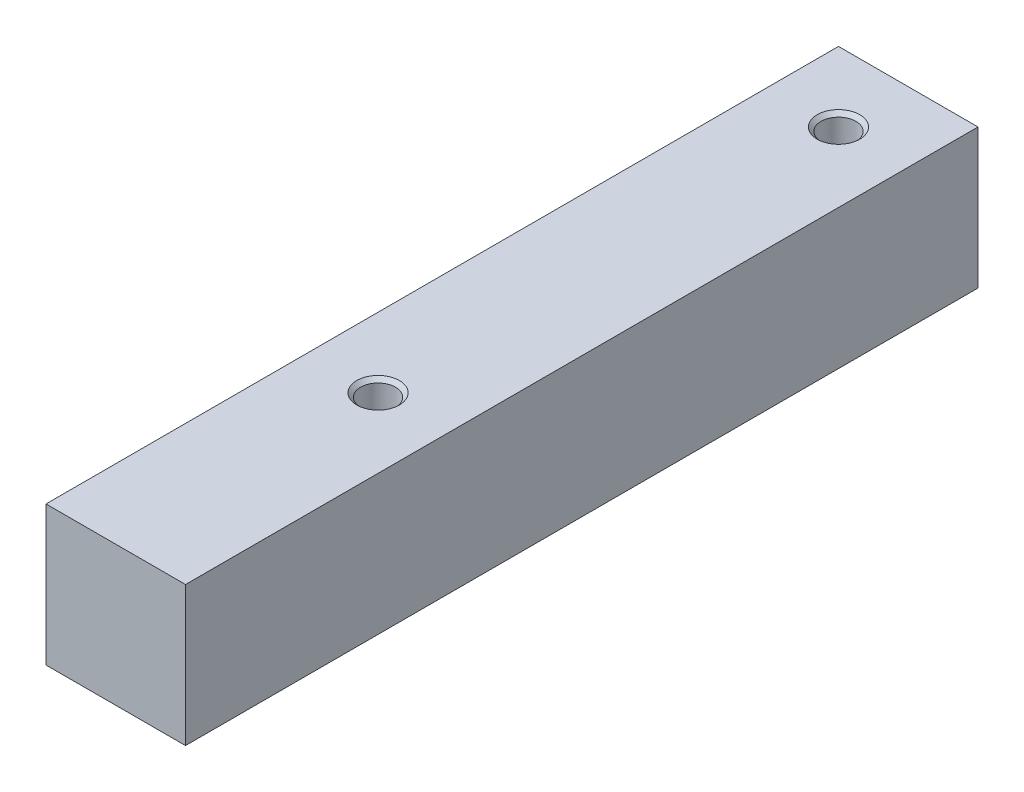
ISO-10303-21;
HEADER;
FILE_DESCRIPTION(('STEP AP214'),'2;1');
FILE_NAME('part.step','',(''),(''),'','','');
FILE_SCHEMA(('AUTOMOTIVE_DESIGN { 1 0 10303 214 1 1 1 1 }'));
ENDSEC;
DATA;
#1=APPLICATION_CONTEXT('core data for automotive mechanical design processes');
#2=APPLICATION_PROTOCOL_DEFINITION('international standard','automotive_design',2000,#1);
#3=PRODUCT_CONTEXT('',#1,'mechanical');
#4=PRODUCT('Part','Part','',(#3));
#5=PRODUCT_RELATED_PRODUCT_CATEGORY('part','',(#4));
#6=PRODUCT_DEFINITION_FORMATION('','',#4);
#7=PRODUCT_DEFINITION_CONTEXT('part definition',#1,'design');
#8=PRODUCT_DEFINITION('design','',#6,#7);
#9=PRODUCT_DEFINITION_SHAPE('','',#8);
#10=(LENGTH_UNIT() NAMED_UNIT(*) SI_UNIT(.MILLI.,.METRE.));
#11=(NAMED_UNIT(*) PLANE_ANGLE_UNIT() SI_UNIT($,.RADIAN.));
#12=(NAMED_UNIT(*) SI_UNIT($,.STERADIAN.) SOLID_ANGLE_UNIT());
#13=UNCERTAINTY_MEASURE_WITH_UNIT(LENGTH_MEASURE(1.E-05),#10,'distance_accuracy_value','');
#14=(GEOMETRIC_REPRESENTATION_CONTEXT(3) GLOBAL_UNCERTAINTY_ASSIGNED_CONTEXT((#13)) GLOBAL_UNIT_ASSIGNED_CONTEXT((#10,
#11,#12)) REPRESENTATION_CONTEXT('',''));
#15=CARTESIAN_POINT('',(0.,0.,0.));
#16=DIRECTION('',(0.,0.,1.));
#17=DIRECTION('',(1.,0.,0.));
#18=AXIS2_PLACEMENT_3D('',#15,#16,#17);
#19=CARTESIAN_POINT('',(-5.,5.,-2.));
#20=DIRECTION('',(-1.,0.,0.));
#21=DIRECTION('',(0.,-1.,0.));
#22=AXIS2_PLACEMENT_3D('',#19,#20,#21);
#23=PLANE('',#22);
#24=DIRECTION('',(0.,0.,1.));
#25=VECTOR('',#24,1.);
#26=CARTESIAN_POINT('',(-5.,-5.,-2.));
#27=LINE('',#26,#25);
#28=CARTESIAN_POINT('',(-5.,-5.,-2.));
#29=VERTEX_POINT('',#28);
#30=CARTESIAN_POINT('',(-5.,-5.,54.8000000000001));
#31=VERTEX_POINT('',#30);
#32=EDGE_CURVE('E39',#29,#31,#27,.T.);
#33=ORIENTED_EDGE('',*,*,#32,.T.);
#34=DIRECTION('',(0.,-1.,0.));
#35=VECTOR('',#34,1.);
#36=CARTESIAN_POINT('',(-5.,5.,54.8000000000001));
#37=LINE('',#36,#35);
#38=CARTESIAN_POINT('',(-5.,5.,54.8000000000001));
#39=VERTEX_POINT('',#38);
#40=EDGE_CURVE('E90',#39,#31,#37,.T.);
#41=ORIENTED_EDGE('',*,*,#40,.F.);
#42=DIRECTION('',(0.,0.,1.));
#43=VECTOR('',#42,1.);
#44=CARTESIAN_POINT('',(-5.,5.,-2.));
#45=LINE('',#44,#43);
#46=CARTESIAN_POINT('',(-5.,5.,-2.));
#47=VERTEX_POINT('',#46);
#48=EDGE_CURVE('E12',#47,#39,#45,.T.);
#49=ORIENTED_EDGE('',*,*,#48,.F.);
#50=DIRECTION('',(0.,-1.,0.));
#51=VECTOR('',#50,1.);
#52=CARTESIAN_POINT('',(-5.,5.,-2.));
#53=LINE('',#52,#51);
#54=EDGE_CURVE('E96',#47,#29,#53,.T.);
#55=ORIENTED_EDGE('',*,*,#54,.T.);
#56=EDGE_LOOP('',(#33,#41,#49,#55));
#57=FACE_BOUND('',#56,.T.);
#58=ADVANCED_FACE('F36',(#57),#23,.T.);
#59=CARTESIAN_POINT('',(-5.,5.,-2.));
#60=DIRECTION('',(0.,1.,0.));
#61=DIRECTION('',(0.,0.,1.));
#62=AXIS2_PLACEMENT_3D('',#59,#60,#61);
#63=PLANE('',#62);
#64=CARTESIAN_POINT('',(0.,5.,36.));
#65=DIRECTION('',(0.,1.,0.));
#66=DIRECTION('',(0.,0.,1.));
#67=AXIS2_PLACEMENT_3D('',#64,#65,#66);
#68=CIRCLE('',#67,1.525);
#69=CARTESIAN_POINT('',(0.,5.,37.525));
#70=VERTEX_POINT('',#69);
#71=EDGE_CURVE('E159',#70,#70,#68,.T.);
#72=ORIENTED_EDGE('',*,*,#71,.F.);
#73=EDGE_LOOP('',(#72));
#74=FACE_BOUND('',#73,.T.);
#75=CARTESIAN_POINT('',(0.,5.,3.));
#76=DIRECTION('',(0.,1.,0.));
#77=DIRECTION('',(0.,0.,1.));
#78=AXIS2_PLACEMENT_3D('',#75,#76,#77);
#79=CIRCLE('',#78,1.525);
#80=CARTESIAN_POINT('',(0.,5.,4.525));
#81=VERTEX_POINT('',#80);
#82=EDGE_CURVE('E165',#81,#81,#79,.T.);
#83=ORIENTED_EDGE('',*,*,#82,.F.);
#84=EDGE_LOOP('',(#83));
#85=FACE_BOUND('',#84,.T.);
#86=ORIENTED_EDGE('',*,*,#48,.T.);
#87=DIRECTION('',(-1.,0.,0.));
#88=VECTOR('',#87,1.);
#89=CARTESIAN_POINT('',(-5.,5.,54.8000000000001));
#90=LINE('',#89,#88);
#91=CARTESIAN_POINT('',(5.,5.,54.8000000000001));
#92=VERTEX_POINT('',#91);
#93=EDGE_CURVE('E86',#92,#39,#90,.T.);
#94=ORIENTED_EDGE('',*,*,#93,.F.);
#95=DIRECTION('',(0.,0.,1.));
#96=VECTOR('',#95,1.);
#97=CARTESIAN_POINT('',(5.,5.,-2.));
#98=LINE('',#97,#96);
#99=CARTESIAN_POINT('',(5.,5.,-2.));
#100=VERTEX_POINT('',#99);
#101=EDGE_CURVE('E44',#100,#92,#98,.T.);
#102=ORIENTED_EDGE('',*,*,#101,.F.);
#103=DIRECTION('',(-1.,0.,0.));
#104=VECTOR('',#103,1.);
#105=CARTESIAN_POINT('',(-5.,5.,-2.));
#106=LINE('',#105,#104);
#107=EDGE_CURVE('E108',#100,#47,#106,.T.);
#108=ORIENTED_EDGE('',*,*,#107,.T.);
#109=EDGE_LOOP('',(#86,#94,#102,#108));
#110=FACE_BOUND('',#109,.T.);
#111=ADVANCED_FACE('F87',(#74,#85,#110),#63,.T.);
#112=CARTESIAN_POINT('',(5.,5.,-2.));
#113=DIRECTION('',(1.,0.,0.));
#114=DIRECTION('',(0.,1.,0.));
#115=AXIS2_PLACEMENT_3D('',#112,#113,#114);
#116=PLANE('',#115);
#117=ORIENTED_EDGE('',*,*,#101,.T.);
#118=DIRECTION('',(0.,1.,0.));
#119=VECTOR('',#118,1.);
#120=CARTESIAN_POINT('',(5.,5.,54.8000000000001));
#121=LINE('',#120,#119);
#122=CARTESIAN_POINT('',(5.,-5.,54.8000000000001));
#123=VERTEX_POINT('',#122);
#124=EDGE_CURVE('E78',#123,#92,#121,.T.);
#125=ORIENTED_EDGE('',*,*,#124,.F.);
#126=DIRECTION('',(0.,0.,1.));
#127=VECTOR('',#126,1.);
#128=CARTESIAN_POINT('',(5.,-5.,-2.));
#129=LINE('',#128,#127);
#130=CARTESIAN_POINT('',(5.,-5.,-2.));
#131=VERTEX_POINT('',#130);
#132=EDGE_CURVE('E83',#131,#123,#129,.T.);
#133=ORIENTED_EDGE('',*,*,#132,.F.);
#134=DIRECTION('',(0.,1.,0.));
#135=VECTOR('',#134,1.);
#136=CARTESIAN_POINT('',(5.,5.,-2.));
#137=LINE('',#136,#135);
#138=EDGE_CURVE('E81',#131,#100,#137,.T.);
#139=ORIENTED_EDGE('',*,*,#138,.T.);
#140=EDGE_LOOP('',(#117,#125,#133,#139));
#141=FACE_BOUND('',#140,.T.);
#142=ADVANCED_FACE('F76',(#141),#116,.T.);
#143=CARTESIAN_POINT('',(-5.,-5.,-2.));
#144=DIRECTION('',(0.,-1.,0.));
#145=DIRECTION('',(0.,0.,-1.));
#146=AXIS2_PLACEMENT_3D('',#143,#144,#145);
#147=PLANE('',#146);
#148=CARTESIAN_POINT('',(0.,-5.,36.));
#149=DIRECTION('',(0.,1.,0.));
#150=DIRECTION('',(0.,0.,1.));
#151=AXIS2_PLACEMENT_3D('',#148,#149,#150);
#152=CIRCLE('',#151,1.25);
#153=CARTESIAN_POINT('',(0.,-5.,37.25));
#154=VERTEX_POINT('',#153);
#155=EDGE_CURVE('E161',#154,#154,#152,.T.);
#156=ORIENTED_EDGE('',*,*,#155,.T.);
#157=EDGE_LOOP('',(#156));
#158=FACE_BOUND('',#157,.T.);
#159=CARTESIAN_POINT('',(0.,-5.,3.));
#160=DIRECTION('',(0.,1.,0.));
#161=DIRECTION('',(0.,0.,1.));
#162=AXIS2_PLACEMENT_3D('',#159,#160,#161);
#163=CIRCLE('',#162,1.25);
#164=CARTESIAN_POINT('',(0.,-5.,4.25));
#165=VERTEX_POINT('',#164);
#166=EDGE_CURVE('E91',#165,#165,#163,.T.);
#167=ORIENTED_EDGE('',*,*,#166,.T.);
#168=EDGE_LOOP('',(#167));
#169=FACE_BOUND('',#168,.T.);
#170=ORIENTED_EDGE('',*,*,#132,.T.);
#171=DIRECTION('',(1.,0.,0.));
#172=VECTOR('',#171,1.);
#173=CARTESIAN_POINT('',(-5.,-5.,54.8000000000001));
#174=LINE('',#173,#172);
#175=EDGE_CURVE('E95',#31,#123,#174,.T.);
#176=ORIENTED_EDGE('',*,*,#175,.F.);
#177=ORIENTED_EDGE('',*,*,#32,.F.);
#178=DIRECTION('',(1.,0.,0.));
#179=VECTOR('',#178,1.);
#180=CARTESIAN_POINT('',(-5.,-5.,-2.));
#181=LINE('',#180,#179);
#182=EDGE_CURVE('E98',#29,#131,#181,.T.);
#183=ORIENTED_EDGE('',*,*,#182,.T.);
#184=EDGE_LOOP('',(#170,#176,#177,#183));
#185=FACE_BOUND('',#184,.T.);
#186=ADVANCED_FACE('F111',(#158,#169,#185),#147,.T.);
#187=CARTESIAN_POINT('',(0.,0.,-2.));
#188=DIRECTION('',(0.,0.,1.));
#189=DIRECTION('',(1.,0.,0.));
#190=AXIS2_PLACEMENT_3D('',#187,#188,#189);
#191=PLANE('',#190);
#192=ORIENTED_EDGE('',*,*,#54,.F.);
#193=ORIENTED_EDGE('',*,*,#107,.F.);
#194=ORIENTED_EDGE('',*,*,#138,.F.);
#195=ORIENTED_EDGE('',*,*,#182,.F.);
#196=EDGE_LOOP('',(#192,#193,#194,#195));
#197=FACE_BOUND('',#196,.T.);
#198=ADVANCED_FACE('F113',(#197),#191,.F.);
#199=CARTESIAN_POINT('',(-5.00000000000011,77.3421356237302,54.8000000000001));
#200=DIRECTION('',(0.,0.,1.));
#201=DIRECTION('',(0.,-1.,0.));
#202=AXIS2_PLACEMENT_3D('',#199,#200,#201);
#203=PLANE('',#202);
#204=ORIENTED_EDGE('',*,*,#93,.T.);
#205=ORIENTED_EDGE('',*,*,#40,.T.);
#206=ORIENTED_EDGE('',*,*,#175,.T.);
#207=ORIENTED_EDGE('',*,*,#124,.T.);
#208=EDGE_LOOP('',(#204,#205,#206,#207));
#209=FACE_BOUND('',#208,.T.);
#210=ADVANCED_FACE('F93',(#209),#203,.T.);
#211=CARTESIAN_POINT('',(0.,5.,3.));
#212=DIRECTION('',(0.,1.,0.));
#213=DIRECTION('',(0.,0.,1.));
#214=AXIS2_PLACEMENT_3D('',#211,#212,#213);
#215=CYLINDRICAL_SURFACE('',#214,1.25);
#216=ORIENTED_EDGE('',*,*,#166,.F.);
#217=EDGE_LOOP('',(#216));
#218=FACE_BOUND('',#217,.T.);
#219=CARTESIAN_POINT('',(0.,4.725,3.));
#220=DIRECTION('',(0.,1.,0.));
#221=DIRECTION('',(0.,0.,1.));
#222=AXIS2_PLACEMENT_3D('',#219,#220,#221);
#223=CIRCLE('',#222,1.25);
#224=CARTESIAN_POINT('',(0.,4.725,4.25));
#225=VERTEX_POINT('',#224);
#226=EDGE_CURVE('E167',#225,#225,#223,.T.);
#227=ORIENTED_EDGE('',*,*,#226,.T.);
#228=EDGE_LOOP('',(#227));
#229=FACE_BOUND('',#228,.T.);
#230=ADVANCED_FACE('F137',(#218,#229),#215,.F.);
#231=CARTESIAN_POINT('',(0.,5.,3.));
#232=DIRECTION('',(0.,1.,0.));
#233=DIRECTION('',(0.,0.,1.));
#234=AXIS2_PLACEMENT_3D('',#231,#232,#233);
#235=CONICAL_SURFACE('',#234,1.525,0.785398163397451);
#236=ORIENTED_EDGE('',*,*,#226,.F.);
#237=EDGE_LOOP('',(#236));
#238=FACE_BOUND('',#237,.T.);
#239=ORIENTED_EDGE('',*,*,#82,.T.);
#240=EDGE_LOOP('',(#239));
#241=FACE_BOUND('',#240,.T.);
#242=ADVANCED_FACE('F140',(#238,#241),#235,.F.);
#243=CARTESIAN_POINT('',(0.,5.,36.));
#244=DIRECTION('',(0.,1.,0.));
#245=DIRECTION('',(0.,0.,1.));
#246=AXIS2_PLACEMENT_3D('',#243,#244,#245);
#247=CYLINDRICAL_SURFACE('',#246,1.25);
#248=ORIENTED_EDGE('',*,*,#155,.F.);
#249=EDGE_LOOP('',(#248));
#250=FACE_BOUND('',#249,.T.);
#251=CARTESIAN_POINT('',(0.,4.725,36.));
#252=DIRECTION('',(0.,1.,0.));
#253=DIRECTION('',(0.,0.,1.));
#254=AXIS2_PLACEMENT_3D('',#251,#252,#253);
#255=CIRCLE('',#254,1.25);
#256=CARTESIAN_POINT('',(0.,4.725,37.25));
#257=VERTEX_POINT('',#256);
#258=EDGE_CURVE('E157',#257,#257,#255,.T.);
#259=ORIENTED_EDGE('',*,*,#258,.T.);
#260=EDGE_LOOP('',(#259));
#261=FACE_BOUND('',#260,.T.);
#262=ADVANCED_FACE('F144',(#250,#261),#247,.F.);
#263=CARTESIAN_POINT('',(0.,5.,36.));
#264=DIRECTION('',(0.,1.,0.));
#265=DIRECTION('',(0.,0.,1.));
#266=AXIS2_PLACEMENT_3D('',#263,#264,#265);
#267=CONICAL_SURFACE('',#266,1.525,0.785398163397451);
#268=ORIENTED_EDGE('',*,*,#258,.F.);
#269=EDGE_LOOP('',(#268));
#270=FACE_BOUND('',#269,.T.);
#271=ORIENTED_EDGE('',*,*,#71,.T.);
#272=EDGE_LOOP('',(#271));
#273=FACE_BOUND('',#272,.T.);
#274=ADVANCED_FACE('F148',(#270,#273),#267,.F.);
#275=CLOSED_SHELL('',(#58,#111,#142,#186,#198,#210,#230,#242,#262,#274));
#276=MANIFOLD_SOLID_BREP('B2',#275);
#277=ADVANCED_BREP_SHAPE_REPRESENTATION('',(#18,#276),#14);
#278=SHAPE_DEFINITION_REPRESENTATION(#9,#277);
ENDSEC;
END-ISO-10303-21;
